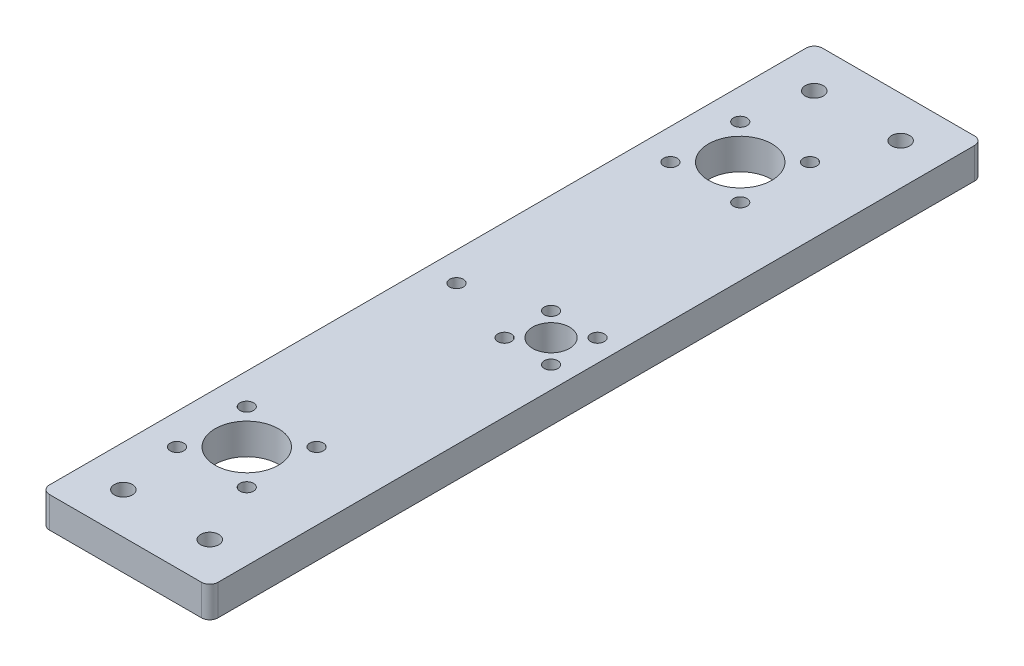
ISO-10303-21;
HEADER;
FILE_DESCRIPTION(('STEP AP214'),'2;1');
FILE_NAME('part.step','',(''),(''),'','','');
FILE_SCHEMA(('AUTOMOTIVE_DESIGN { 1 0 10303 214 1 1 1 1 }'));
ENDSEC;
DATA;
#1=APPLICATION_CONTEXT('core data for automotive mechanical design processes');
#2=APPLICATION_PROTOCOL_DEFINITION('international standard','automotive_design',2000,#1);
#3=PRODUCT_CONTEXT('',#1,'mechanical');
#4=PRODUCT('Part','Part','',(#3));
#5=PRODUCT_RELATED_PRODUCT_CATEGORY('part','',(#4));
#6=PRODUCT_DEFINITION_FORMATION('','',#4);
#7=PRODUCT_DEFINITION_CONTEXT('part definition',#1,'design');
#8=PRODUCT_DEFINITION('design','',#6,#7);
#9=PRODUCT_DEFINITION_SHAPE('','',#8);
#10=(LENGTH_UNIT() NAMED_UNIT(*) SI_UNIT(.MILLI.,.METRE.));
#11=(NAMED_UNIT(*) PLANE_ANGLE_UNIT() SI_UNIT($,.RADIAN.));
#12=(NAMED_UNIT(*) SI_UNIT($,.STERADIAN.) SOLID_ANGLE_UNIT());
#13=UNCERTAINTY_MEASURE_WITH_UNIT(LENGTH_MEASURE(1.E-05),#10,'distance_accuracy_value','');
#14=(GEOMETRIC_REPRESENTATION_CONTEXT(3) GLOBAL_UNCERTAINTY_ASSIGNED_CONTEXT((#13)) GLOBAL_UNIT_ASSIGNED_CONTEXT((#10,
#11,#12)) REPRESENTATION_CONTEXT('',''));
#15=CARTESIAN_POINT('',(0.,0.,0.));
#16=DIRECTION('',(0.,0.,1.));
#17=DIRECTION('',(1.,0.,0.));
#18=AXIS2_PLACEMENT_3D('',#15,#16,#17);
#19=CARTESIAN_POINT('',(18.5,0.,-92.));
#20=DIRECTION('',(0.,1.,0.));
#21=DIRECTION('',(0.,0.,1.));
#22=AXIS2_PLACEMENT_3D('',#19,#20,#21);
#23=CYLINDRICAL_SURFACE('',#22,2.);
#24=CARTESIAN_POINT('',(18.5,7.5,-92.));
#25=DIRECTION('',(0.,1.,0.));
#26=DIRECTION('',(0.,0.,1.));
#27=AXIS2_PLACEMENT_3D('',#24,#25,#26);
#28=CIRCLE('',#27,2.);
#29=CARTESIAN_POINT('',(20.5,7.5,-92.));
#30=VERTEX_POINT('',#29);
#31=CARTESIAN_POINT('',(18.5,7.5,-94.));
#32=VERTEX_POINT('',#31);
#33=EDGE_CURVE('E134',#30,#32,#28,.T.);
#34=ORIENTED_EDGE('',*,*,#33,.F.);
#35=DIRECTION('',(0.,1.,0.));
#36=VECTOR('',#35,1.);
#37=CARTESIAN_POINT('',(20.5,0.,-92.));
#38=LINE('',#37,#36);
#39=CARTESIAN_POINT('',(20.5,0.,-92.));
#40=VERTEX_POINT('',#39);
#41=EDGE_CURVE('E11',#40,#30,#38,.T.);
#42=ORIENTED_EDGE('',*,*,#41,.F.);
#43=CARTESIAN_POINT('',(18.5,0.,-92.));
#44=DIRECTION('',(0.,1.,0.));
#45=DIRECTION('',(0.,0.,1.));
#46=AXIS2_PLACEMENT_3D('',#43,#44,#45);
#47=CIRCLE('',#46,2.);
#48=CARTESIAN_POINT('',(18.5,0.,-94.));
#49=VERTEX_POINT('',#48);
#50=EDGE_CURVE('E155',#40,#49,#47,.T.);
#51=ORIENTED_EDGE('',*,*,#50,.T.);
#52=DIRECTION('',(0.,1.,0.));
#53=VECTOR('',#52,1.);
#54=CARTESIAN_POINT('',(18.5,0.,-94.));
#55=LINE('',#54,#53);
#56=EDGE_CURVE('E40',#49,#32,#55,.T.);
#57=ORIENTED_EDGE('',*,*,#56,.T.);
#58=EDGE_LOOP('',(#34,#42,#51,#57));
#59=FACE_BOUND('',#58,.T.);
#60=ADVANCED_FACE('F37',(#59),#23,.T.);
#61=CARTESIAN_POINT('',(20.5,0.,92.));
#62=DIRECTION('',(1.,0.,0.));
#63=DIRECTION('',(0.,0.,-1.));
#64=AXIS2_PLACEMENT_3D('',#61,#62,#63);
#65=PLANE('',#64);
#66=DIRECTION('',(0.,0.,-1.));
#67=VECTOR('',#66,1.);
#68=CARTESIAN_POINT('',(20.5,7.5,92.));
#69=LINE('',#68,#67);
#70=CARTESIAN_POINT('',(20.5,7.5,92.));
#71=VERTEX_POINT('',#70);
#72=EDGE_CURVE('E153',#71,#30,#69,.T.);
#73=ORIENTED_EDGE('',*,*,#72,.F.);
#74=DIRECTION('',(0.,1.,0.));
#75=VECTOR('',#74,1.);
#76=CARTESIAN_POINT('',(20.5,0.,92.));
#77=LINE('',#76,#75);
#78=CARTESIAN_POINT('',(20.5,0.,92.));
#79=VERTEX_POINT('',#78);
#80=EDGE_CURVE('E46',#79,#71,#77,.T.);
#81=ORIENTED_EDGE('',*,*,#80,.F.);
#82=DIRECTION('',(0.,0.,-1.));
#83=VECTOR('',#82,1.);
#84=CARTESIAN_POINT('',(20.5,0.,92.));
#85=LINE('',#84,#83);
#86=EDGE_CURVE('E124',#79,#40,#85,.T.);
#87=ORIENTED_EDGE('',*,*,#86,.T.);
#88=ORIENTED_EDGE('',*,*,#41,.T.);
#89=EDGE_LOOP('',(#73,#81,#87,#88));
#90=FACE_BOUND('',#89,.T.);
#91=ADVANCED_FACE('F167',(#90),#65,.T.);
#92=CARTESIAN_POINT('',(18.5,0.,92.));
#93=DIRECTION('',(0.,1.,0.));
#94=DIRECTION('',(0.,0.,1.));
#95=AXIS2_PLACEMENT_3D('',#92,#93,#94);
#96=CYLINDRICAL_SURFACE('',#95,2.);
#97=CARTESIAN_POINT('',(18.5,7.5,92.));
#98=DIRECTION('',(0.,1.,0.));
#99=DIRECTION('',(0.,0.,1.));
#100=AXIS2_PLACEMENT_3D('',#97,#98,#99);
#101=CIRCLE('',#100,2.);
#102=CARTESIAN_POINT('',(18.5,7.5,94.));
#103=VERTEX_POINT('',#102);
#104=EDGE_CURVE('E111',#103,#71,#101,.T.);
#105=ORIENTED_EDGE('',*,*,#104,.F.);
#106=DIRECTION('',(0.,1.,0.));
#107=VECTOR('',#106,1.);
#108=CARTESIAN_POINT('',(18.5,0.,94.));
#109=LINE('',#108,#107);
#110=CARTESIAN_POINT('',(18.5,0.,94.));
#111=VERTEX_POINT('',#110);
#112=EDGE_CURVE('E106',#111,#103,#109,.T.);
#113=ORIENTED_EDGE('',*,*,#112,.F.);
#114=CARTESIAN_POINT('',(18.5,0.,92.));
#115=DIRECTION('',(0.,1.,0.));
#116=DIRECTION('',(0.,0.,1.));
#117=AXIS2_PLACEMENT_3D('',#114,#115,#116);
#118=CIRCLE('',#117,2.);
#119=EDGE_CURVE('E109',#111,#79,#118,.T.);
#120=ORIENTED_EDGE('',*,*,#119,.T.);
#121=ORIENTED_EDGE('',*,*,#80,.T.);
#122=EDGE_LOOP('',(#105,#113,#120,#121));
#123=FACE_BOUND('',#122,.T.);
#124=ADVANCED_FACE('F108',(#123),#96,.T.);
#125=CARTESIAN_POINT('',(-18.5,0.,94.));
#126=DIRECTION('',(0.,0.,1.));
#127=DIRECTION('',(1.,0.,0.));
#128=AXIS2_PLACEMENT_3D('',#125,#126,#127);
#129=PLANE('',#128);
#130=DIRECTION('',(1.,0.,0.));
#131=VECTOR('',#130,1.);
#132=CARTESIAN_POINT('',(-18.5,7.5,94.));
#133=LINE('',#132,#131);
#134=CARTESIAN_POINT('',(-18.5,7.5,94.));
#135=VERTEX_POINT('',#134);
#136=EDGE_CURVE('E150',#135,#103,#133,.T.);
#137=ORIENTED_EDGE('',*,*,#136,.F.);
#138=DIRECTION('',(0.,1.,0.));
#139=VECTOR('',#138,1.);
#140=CARTESIAN_POINT('',(-18.5,0.,94.));
#141=LINE('',#140,#139);
#142=CARTESIAN_POINT('',(-18.5,0.,94.));
#143=VERTEX_POINT('',#142);
#144=EDGE_CURVE('E116',#143,#135,#141,.T.);
#145=ORIENTED_EDGE('',*,*,#144,.F.);
#146=DIRECTION('',(1.,0.,0.));
#147=VECTOR('',#146,1.);
#148=CARTESIAN_POINT('',(-18.5,0.,94.));
#149=LINE('',#148,#147);
#150=EDGE_CURVE('E122',#143,#111,#149,.T.);
#151=ORIENTED_EDGE('',*,*,#150,.T.);
#152=ORIENTED_EDGE('',*,*,#112,.T.);
#153=EDGE_LOOP('',(#137,#145,#151,#152));
#154=FACE_BOUND('',#153,.T.);
#155=ADVANCED_FACE('F126',(#154),#129,.T.);
#156=CARTESIAN_POINT('',(-18.5,0.,92.));
#157=DIRECTION('',(0.,1.,0.));
#158=DIRECTION('',(0.,0.,1.));
#159=AXIS2_PLACEMENT_3D('',#156,#157,#158);
#160=CYLINDRICAL_SURFACE('',#159,2.);
#161=CARTESIAN_POINT('',(-18.5,7.5,92.));
#162=DIRECTION('',(0.,1.,0.));
#163=DIRECTION('',(0.,0.,1.));
#164=AXIS2_PLACEMENT_3D('',#161,#162,#163);
#165=CIRCLE('',#164,2.);
#166=CARTESIAN_POINT('',(-20.5,7.5,92.));
#167=VERTEX_POINT('',#166);
#168=EDGE_CURVE('E147',#167,#135,#165,.T.);
#169=ORIENTED_EDGE('',*,*,#168,.F.);
#170=DIRECTION('',(0.,1.,0.));
#171=VECTOR('',#170,1.);
#172=CARTESIAN_POINT('',(-20.5,0.,92.));
#173=LINE('',#172,#171);
#174=CARTESIAN_POINT('',(-20.5,0.,92.));
#175=VERTEX_POINT('',#174);
#176=EDGE_CURVE('E159',#175,#167,#173,.T.);
#177=ORIENTED_EDGE('',*,*,#176,.F.);
#178=CARTESIAN_POINT('',(-18.5,0.,92.));
#179=DIRECTION('',(0.,1.,0.));
#180=DIRECTION('',(0.,0.,1.));
#181=AXIS2_PLACEMENT_3D('',#178,#179,#180);
#182=CIRCLE('',#181,2.);
#183=EDGE_CURVE('E127',#175,#143,#182,.T.);
#184=ORIENTED_EDGE('',*,*,#183,.T.);
#185=ORIENTED_EDGE('',*,*,#144,.T.);
#186=EDGE_LOOP('',(#169,#177,#184,#185));
#187=FACE_BOUND('',#186,.T.);
#188=ADVANCED_FACE('F180',(#187),#160,.T.);
#189=CARTESIAN_POINT('',(-20.5,0.,-92.));
#190=DIRECTION('',(-1.,0.,0.));
#191=DIRECTION('',(0.,0.,1.));
#192=AXIS2_PLACEMENT_3D('',#189,#190,#191);
#193=PLANE('',#192);
#194=DIRECTION('',(0.,0.,1.));
#195=VECTOR('',#194,1.);
#196=CARTESIAN_POINT('',(-20.5,7.5,-92.));
#197=LINE('',#196,#195);
#198=CARTESIAN_POINT('',(-20.5,7.5,-92.));
#199=VERTEX_POINT('',#198);
#200=EDGE_CURVE('E144',#199,#167,#197,.T.);
#201=ORIENTED_EDGE('',*,*,#200,.F.);
#202=DIRECTION('',(0.,1.,0.));
#203=VECTOR('',#202,1.);
#204=CARTESIAN_POINT('',(-20.5,0.,-92.));
#205=LINE('',#204,#203);
#206=CARTESIAN_POINT('',(-20.5,0.,-92.));
#207=VERTEX_POINT('',#206);
#208=EDGE_CURVE('E161',#207,#199,#205,.T.);
#209=ORIENTED_EDGE('',*,*,#208,.F.);
#210=DIRECTION('',(0.,0.,1.));
#211=VECTOR('',#210,1.);
#212=CARTESIAN_POINT('',(-20.5,0.,-92.));
#213=LINE('',#212,#211);
#214=EDGE_CURVE('E129',#207,#175,#213,.T.);
#215=ORIENTED_EDGE('',*,*,#214,.T.);
#216=ORIENTED_EDGE('',*,*,#176,.T.);
#217=EDGE_LOOP('',(#201,#209,#215,#216));
#218=FACE_BOUND('',#217,.T.);
#219=ADVANCED_FACE('F183',(#218),#193,.T.);
#220=CARTESIAN_POINT('',(-18.5,0.,-92.));
#221=DIRECTION('',(0.,1.,0.));
#222=DIRECTION('',(0.,0.,1.));
#223=AXIS2_PLACEMENT_3D('',#220,#221,#222);
#224=CYLINDRICAL_SURFACE('',#223,2.);
#225=CARTESIAN_POINT('',(-18.5,7.5,-92.));
#226=DIRECTION('',(0.,1.,0.));
#227=DIRECTION('',(0.,0.,1.));
#228=AXIS2_PLACEMENT_3D('',#225,#226,#227);
#229=CIRCLE('',#228,2.);
#230=CARTESIAN_POINT('',(-18.5,7.5,-94.));
#231=VERTEX_POINT('',#230);
#232=EDGE_CURVE('E141',#231,#199,#229,.T.);
#233=ORIENTED_EDGE('',*,*,#232,.F.);
#234=DIRECTION('',(0.,1.,0.));
#235=VECTOR('',#234,1.);
#236=CARTESIAN_POINT('',(-18.5,0.,-94.));
#237=LINE('',#236,#235);
#238=CARTESIAN_POINT('',(-18.5,0.,-94.));
#239=VERTEX_POINT('',#238);
#240=EDGE_CURVE('E162',#239,#231,#237,.T.);
#241=ORIENTED_EDGE('',*,*,#240,.F.);
#242=CARTESIAN_POINT('',(-18.5,0.,-92.));
#243=DIRECTION('',(0.,1.,0.));
#244=DIRECTION('',(0.,0.,1.));
#245=AXIS2_PLACEMENT_3D('',#242,#243,#244);
#246=CIRCLE('',#245,2.);
#247=EDGE_CURVE('E409',#239,#207,#246,.T.);
#248=ORIENTED_EDGE('',*,*,#247,.T.);
#249=ORIENTED_EDGE('',*,*,#208,.T.);
#250=EDGE_LOOP('',(#233,#241,#248,#249));
#251=FACE_BOUND('',#250,.T.);
#252=ADVANCED_FACE('F187',(#251),#224,.T.);
#253=CARTESIAN_POINT('',(18.5,0.,-94.));
#254=DIRECTION('',(0.,0.,-1.));
#255=DIRECTION('',(-1.,0.,0.));
#256=AXIS2_PLACEMENT_3D('',#253,#254,#255);
#257=PLANE('',#256);
#258=DIRECTION('',(-1.,0.,0.));
#259=VECTOR('',#258,1.);
#260=CARTESIAN_POINT('',(18.5,7.5,-94.));
#261=LINE('',#260,#259);
#262=EDGE_CURVE('E137',#32,#231,#261,.T.);
#263=ORIENTED_EDGE('',*,*,#262,.F.);
#264=ORIENTED_EDGE('',*,*,#56,.F.);
#265=DIRECTION('',(-1.,0.,0.));
#266=VECTOR('',#265,1.);
#267=CARTESIAN_POINT('',(18.5,0.,-94.));
#268=LINE('',#267,#266);
#269=EDGE_CURVE('E407',#49,#239,#268,.T.);
#270=ORIENTED_EDGE('',*,*,#269,.T.);
#271=ORIENTED_EDGE('',*,*,#240,.T.);
#272=EDGE_LOOP('',(#263,#264,#270,#271));
#273=FACE_BOUND('',#272,.T.);
#274=ADVANCED_FACE('F164',(#273),#257,.T.);
#275=CARTESIAN_POINT('',(18.5,0.,-92.));
#276=DIRECTION('',(0.,1.,0.));
#277=DIRECTION('',(0.,0.,1.));
#278=AXIS2_PLACEMENT_3D('',#275,#276,#277);
#279=PLANE('',#278);
#280=CARTESIAN_POINT('',(-4.5,0.,-60.));
#281=DIRECTION('',(0.,1.,0.));
#282=DIRECTION('',(0.,0.,-1.));
#283=AXIS2_PLACEMENT_3D('',#280,#281,#282);
#284=CIRCLE('',#283,7.7);
#285=CARTESIAN_POINT('',(-4.5,0.,-67.7));
#286=VERTEX_POINT('',#285);
#287=EDGE_CURVE('E286',#286,#286,#284,.T.);
#288=ORIENTED_EDGE('',*,*,#287,.T.);
#289=EDGE_LOOP('',(#288));
#290=FACE_BOUND('',#289,.T.);
#291=CARTESIAN_POINT('',(-13.5,0.,0.));
#292=DIRECTION('',(0.,1.,0.));
#293=DIRECTION('',(0.,0.,-1.));
#294=AXIS2_PLACEMENT_3D('',#291,#292,#293);
#295=CIRCLE('',#294,1.65);
#296=CARTESIAN_POINT('',(-13.5,0.,-1.65));
#297=VERTEX_POINT('',#296);
#298=EDGE_CURVE('E294',#297,#297,#295,.T.);
#299=ORIENTED_EDGE('',*,*,#298,.T.);
#300=EDGE_LOOP('',(#299));
#301=FACE_BOUND('',#300,.T.);
#302=CARTESIAN_POINT('',(15.1568542494924,0.,5.65685424949238));
#303=DIRECTION('',(0.,1.,0.));
#304=DIRECTION('',(0.,0.,-1.));
#305=AXIS2_PLACEMENT_3D('',#302,#303,#304);
#306=CIRCLE('',#305,1.65);
#307=CARTESIAN_POINT('',(15.1568542494924,0.,4.00685424949238));
#308=VERTEX_POINT('',#307);
#309=EDGE_CURVE('E300',#308,#308,#306,.T.);
#310=ORIENTED_EDGE('',*,*,#309,.T.);
#311=EDGE_LOOP('',(#310));
#312=FACE_BOUND('',#311,.T.);
#313=CARTESIAN_POINT('',(3.84314575050763,0.,5.65685424949238));
#314=DIRECTION('',(0.,1.,0.));
#315=DIRECTION('',(0.,0.,-1.));
#316=AXIS2_PLACEMENT_3D('',#313,#314,#315);
#317=CIRCLE('',#316,1.65);
#318=CARTESIAN_POINT('',(3.84314575050763,0.,4.00685424949238));
#319=VERTEX_POINT('',#318);
#320=EDGE_CURVE('E306',#319,#319,#317,.T.);
#321=ORIENTED_EDGE('',*,*,#320,.T.);
#322=EDGE_LOOP('',(#321));
#323=FACE_BOUND('',#322,.T.);
#324=CARTESIAN_POINT('',(3.84314575050763,0.,-5.65685424949238));
#325=DIRECTION('',(0.,1.,0.));
#326=DIRECTION('',(0.,0.,-1.));
#327=AXIS2_PLACEMENT_3D('',#324,#325,#326);
#328=CIRCLE('',#327,1.65);
#329=CARTESIAN_POINT('',(3.84314575050763,0.,-7.30685424949238));
#330=VERTEX_POINT('',#329);
#331=EDGE_CURVE('E312',#330,#330,#328,.T.);
#332=ORIENTED_EDGE('',*,*,#331,.T.);
#333=EDGE_LOOP('',(#332));
#334=FACE_BOUND('',#333,.T.);
#335=CARTESIAN_POINT('',(-12.9852813742386,0.,-51.5147186257614));
#336=DIRECTION('',(0.,1.,0.));
#337=DIRECTION('',(0.,0.,-1.));
#338=AXIS2_PLACEMENT_3D('',#335,#336,#337);
#339=CIRCLE('',#338,1.65);
#340=CARTESIAN_POINT('',(-12.9852813742386,0.,-53.1647186257614));
#341=VERTEX_POINT('',#340);
#342=EDGE_CURVE('E318',#341,#341,#339,.T.);
#343=ORIENTED_EDGE('',*,*,#342,.T.);
#344=EDGE_LOOP('',(#343));
#345=FACE_BOUND('',#344,.T.);
#346=CARTESIAN_POINT('',(-12.9852813742386,0.,-68.4852813742386));
#347=DIRECTION('',(0.,1.,0.));
#348=DIRECTION('',(0.,0.,-1.));
#349=AXIS2_PLACEMENT_3D('',#346,#347,#348);
#350=CIRCLE('',#349,1.65);
#351=CARTESIAN_POINT('',(-12.9852813742386,0.,-70.1352813742386));
#352=VERTEX_POINT('',#351);
#353=EDGE_CURVE('E324',#352,#352,#350,.T.);
#354=ORIENTED_EDGE('',*,*,#353,.T.);
#355=EDGE_LOOP('',(#354));
#356=FACE_BOUND('',#355,.T.);
#357=CARTESIAN_POINT('',(3.98528137423856,0.,-68.4852813742386));
#358=DIRECTION('',(0.,1.,0.));
#359=DIRECTION('',(0.,0.,-1.));
#360=AXIS2_PLACEMENT_3D('',#357,#358,#359);
#361=CIRCLE('',#360,1.65);
#362=CARTESIAN_POINT('',(3.98528137423856,0.,-70.1352813742386));
#363=VERTEX_POINT('',#362);
#364=EDGE_CURVE('E330',#363,#363,#361,.T.);
#365=ORIENTED_EDGE('',*,*,#364,.T.);
#366=EDGE_LOOP('',(#365));
#367=FACE_BOUND('',#366,.T.);
#368=CARTESIAN_POINT('',(3.98528137423858,0.,51.5147186257614));
#369=DIRECTION('',(0.,1.,0.));
#370=DIRECTION('',(0.,0.,-1.));
#371=AXIS2_PLACEMENT_3D('',#368,#369,#370);
#372=CIRCLE('',#371,1.65);
#373=CARTESIAN_POINT('',(3.98528137423858,0.,49.8647186257614));
#374=VERTEX_POINT('',#373);
#375=EDGE_CURVE('E336',#374,#374,#372,.T.);
#376=ORIENTED_EDGE('',*,*,#375,.T.);
#377=EDGE_LOOP('',(#376));
#378=FACE_BOUND('',#377,.T.);
#379=CARTESIAN_POINT('',(-12.9852813742386,0.,51.5147186257614));
#380=DIRECTION('',(0.,1.,0.));
#381=DIRECTION('',(0.,0.,-1.));
#382=AXIS2_PLACEMENT_3D('',#379,#380,#381);
#383=CIRCLE('',#382,1.65);
#384=CARTESIAN_POINT('',(-12.9852813742386,0.,49.8647186257614));
#385=VERTEX_POINT('',#384);
#386=EDGE_CURVE('E342',#385,#385,#383,.T.);
#387=ORIENTED_EDGE('',*,*,#386,.T.);
#388=EDGE_LOOP('',(#387));
#389=FACE_BOUND('',#388,.T.);
#390=CARTESIAN_POINT('',(9.5,0.,0.));
#391=DIRECTION('',(0.,1.,0.));
#392=DIRECTION('',(0.,0.,-1.));
#393=AXIS2_PLACEMENT_3D('',#390,#391,#392);
#394=CIRCLE('',#393,4.5);
#395=CARTESIAN_POINT('',(9.5,0.,-4.5));
#396=VERTEX_POINT('',#395);
#397=EDGE_CURVE('E348',#396,#396,#394,.T.);
#398=ORIENTED_EDGE('',*,*,#397,.T.);
#399=EDGE_LOOP('',(#398));
#400=FACE_BOUND('',#399,.T.);
#401=CARTESIAN_POINT('',(-4.5,0.,60.));
#402=DIRECTION('',(0.,1.,0.));
#403=DIRECTION('',(0.,0.,-1.));
#404=AXIS2_PLACEMENT_3D('',#401,#402,#403);
#405=CIRCLE('',#404,7.7);
#406=CARTESIAN_POINT('',(-4.5,0.,52.3));
#407=VERTEX_POINT('',#406);
#408=EDGE_CURVE('E354',#407,#407,#405,.T.);
#409=ORIENTED_EDGE('',*,*,#408,.T.);
#410=EDGE_LOOP('',(#409));
#411=FACE_BOUND('',#410,.T.);
#412=CARTESIAN_POINT('',(3.98528137423858,0.,68.4852813742386));
#413=DIRECTION('',(0.,1.,0.));
#414=DIRECTION('',(0.,0.,-1.));
#415=AXIS2_PLACEMENT_3D('',#412,#413,#414);
#416=CIRCLE('',#415,1.65);
#417=CARTESIAN_POINT('',(3.98528137423858,0.,66.8352813742386));
#418=VERTEX_POINT('',#417);
#419=EDGE_CURVE('E360',#418,#418,#416,.T.);
#420=ORIENTED_EDGE('',*,*,#419,.T.);
#421=EDGE_LOOP('',(#420));
#422=FACE_BOUND('',#421,.T.);
#423=CARTESIAN_POINT('',(-12.9852813742386,0.,68.4852813742386));
#424=DIRECTION('',(0.,1.,0.));
#425=DIRECTION('',(0.,0.,-1.));
#426=AXIS2_PLACEMENT_3D('',#423,#424,#425);
#427=CIRCLE('',#426,1.65);
#428=CARTESIAN_POINT('',(-12.9852813742386,0.,66.8352813742386));
#429=VERTEX_POINT('',#428);
#430=EDGE_CURVE('E366',#429,#429,#427,.T.);
#431=ORIENTED_EDGE('',*,*,#430,.T.);
#432=EDGE_LOOP('',(#431));
#433=FACE_BOUND('',#432,.T.);
#434=CARTESIAN_POINT('',(15.1568542494924,0.,-5.65685424949238));
#435=DIRECTION('',(0.,1.,0.));
#436=DIRECTION('',(0.,0.,-1.));
#437=AXIS2_PLACEMENT_3D('',#434,#435,#436);
#438=CIRCLE('',#437,1.65);
#439=CARTESIAN_POINT('',(15.1568542494924,0.,-7.30685424949238));
#440=VERTEX_POINT('',#439);
#441=EDGE_CURVE('E372',#440,#440,#438,.T.);
#442=ORIENTED_EDGE('',*,*,#441,.T.);
#443=EDGE_LOOP('',(#442));
#444=FACE_BOUND('',#443,.T.);
#445=CARTESIAN_POINT('',(3.98528137423857,0.,-51.5147186257614));
#446=DIRECTION('',(0.,1.,0.));
#447=DIRECTION('',(0.,0.,-1.));
#448=AXIS2_PLACEMENT_3D('',#445,#446,#447);
#449=CIRCLE('',#448,1.65);
#450=CARTESIAN_POINT('',(3.98528137423857,0.,-53.1647186257614));
#451=VERTEX_POINT('',#450);
#452=EDGE_CURVE('E378',#451,#451,#449,.T.);
#453=ORIENTED_EDGE('',*,*,#452,.T.);
#454=EDGE_LOOP('',(#453));
#455=FACE_BOUND('',#454,.T.);
#456=CARTESIAN_POINT('',(-10.5,0.,84.));
#457=DIRECTION('',(0.,1.,0.));
#458=DIRECTION('',(0.,0.,-1.));
#459=AXIS2_PLACEMENT_3D('',#456,#457,#458);
#460=CIRCLE('',#459,2.19999999999999);
#461=CARTESIAN_POINT('',(-10.5,0.,81.8));
#462=VERTEX_POINT('',#461);
#463=EDGE_CURVE('E384',#462,#462,#460,.T.);
#464=ORIENTED_EDGE('',*,*,#463,.T.);
#465=EDGE_LOOP('',(#464));
#466=FACE_BOUND('',#465,.T.);
#467=CARTESIAN_POINT('',(10.5,0.,84.));
#468=DIRECTION('',(0.,1.,0.));
#469=DIRECTION('',(0.,0.,-1.));
#470=AXIS2_PLACEMENT_3D('',#467,#468,#469);
#471=CIRCLE('',#470,2.19999999999999);
#472=CARTESIAN_POINT('',(10.5,0.,81.8));
#473=VERTEX_POINT('',#472);
#474=EDGE_CURVE('E390',#473,#473,#471,.T.);
#475=ORIENTED_EDGE('',*,*,#474,.T.);
#476=EDGE_LOOP('',(#475));
#477=FACE_BOUND('',#476,.T.);
#478=CARTESIAN_POINT('',(-10.5,0.,-84.));
#479=DIRECTION('',(0.,1.,0.));
#480=DIRECTION('',(0.,0.,-1.));
#481=AXIS2_PLACEMENT_3D('',#478,#479,#480);
#482=CIRCLE('',#481,2.19999999999999);
#483=CARTESIAN_POINT('',(-10.5,0.,-86.2));
#484=VERTEX_POINT('',#483);
#485=EDGE_CURVE('E396',#484,#484,#482,.T.);
#486=ORIENTED_EDGE('',*,*,#485,.T.);
#487=EDGE_LOOP('',(#486));
#488=FACE_BOUND('',#487,.T.);
#489=CARTESIAN_POINT('',(10.5,0.,-84.));
#490=DIRECTION('',(0.,1.,0.));
#491=DIRECTION('',(0.,0.,-1.));
#492=AXIS2_PLACEMENT_3D('',#489,#490,#491);
#493=CIRCLE('',#492,2.19999999999999);
#494=CARTESIAN_POINT('',(10.5,0.,-86.2));
#495=VERTEX_POINT('',#494);
#496=EDGE_CURVE('E138',#495,#495,#493,.T.);
#497=ORIENTED_EDGE('',*,*,#496,.T.);
#498=EDGE_LOOP('',(#497));
#499=FACE_BOUND('',#498,.T.);
#500=ORIENTED_EDGE('',*,*,#50,.F.);
#501=ORIENTED_EDGE('',*,*,#86,.F.);
#502=ORIENTED_EDGE('',*,*,#119,.F.);
#503=ORIENTED_EDGE('',*,*,#150,.F.);
#504=ORIENTED_EDGE('',*,*,#183,.F.);
#505=ORIENTED_EDGE('',*,*,#214,.F.);
#506=ORIENTED_EDGE('',*,*,#247,.F.);
#507=ORIENTED_EDGE('',*,*,#269,.F.);
#508=EDGE_LOOP('',(#500,#501,#502,#503,#504,#505,#506,#507));
#509=FACE_BOUND('',#508,.T.);
#510=ADVANCED_FACE('F120',(#290,#301,#312,#323,#334,#345,#356,#367,#378,#389,#400,#411,#422,
#433,#444,#455,#466,#477,#488,#499,#509),#279,.F.);
#511=CARTESIAN_POINT('',(18.5,7.5,-92.));
#512=DIRECTION('',(0.,1.,0.));
#513=DIRECTION('',(0.,0.,1.));
#514=AXIS2_PLACEMENT_3D('',#511,#512,#513);
#515=PLANE('',#514);
#516=CARTESIAN_POINT('',(-4.5,7.5,-60.));
#517=DIRECTION('',(0.,1.,0.));
#518=DIRECTION('',(0.,0.,-1.));
#519=AXIS2_PLACEMENT_3D('',#516,#517,#518);
#520=CIRCLE('',#519,7.7);
#521=CARTESIAN_POINT('',(-4.5,7.5,-67.7));
#522=VERTEX_POINT('',#521);
#523=EDGE_CURVE('E289',#522,#522,#520,.T.);
#524=ORIENTED_EDGE('',*,*,#523,.F.);
#525=EDGE_LOOP('',(#524));
#526=FACE_BOUND('',#525,.T.);
#527=CARTESIAN_POINT('',(-13.5,7.5,0.));
#528=DIRECTION('',(0.,1.,0.));
#529=DIRECTION('',(0.,0.,-1.));
#530=AXIS2_PLACEMENT_3D('',#527,#528,#529);
#531=CIRCLE('',#530,1.65);
#532=CARTESIAN_POINT('',(-13.5,7.5,-1.65));
#533=VERTEX_POINT('',#532);
#534=EDGE_CURVE('E291',#533,#533,#531,.T.);
#535=ORIENTED_EDGE('',*,*,#534,.F.);
#536=EDGE_LOOP('',(#535));
#537=FACE_BOUND('',#536,.T.);
#538=CARTESIAN_POINT('',(15.1568542494924,7.5,5.65685424949238));
#539=DIRECTION('',(0.,1.,0.));
#540=DIRECTION('',(0.,0.,-1.));
#541=AXIS2_PLACEMENT_3D('',#538,#539,#540);
#542=CIRCLE('',#541,1.65);
#543=CARTESIAN_POINT('',(15.1568542494924,7.5,4.00685424949238));
#544=VERTEX_POINT('',#543);
#545=EDGE_CURVE('E297',#544,#544,#542,.T.);
#546=ORIENTED_EDGE('',*,*,#545,.F.);
#547=EDGE_LOOP('',(#546));
#548=FACE_BOUND('',#547,.T.);
#549=CARTESIAN_POINT('',(3.84314575050763,7.5,5.65685424949238));
#550=DIRECTION('',(0.,1.,0.));
#551=DIRECTION('',(0.,0.,-1.));
#552=AXIS2_PLACEMENT_3D('',#549,#550,#551);
#553=CIRCLE('',#552,1.65);
#554=CARTESIAN_POINT('',(3.84314575050763,7.5,4.00685424949238));
#555=VERTEX_POINT('',#554);
#556=EDGE_CURVE('E303',#555,#555,#553,.T.);
#557=ORIENTED_EDGE('',*,*,#556,.F.);
#558=EDGE_LOOP('',(#557));
#559=FACE_BOUND('',#558,.T.);
#560=CARTESIAN_POINT('',(3.84314575050763,7.5,-5.65685424949238));
#561=DIRECTION('',(0.,1.,0.));
#562=DIRECTION('',(0.,0.,-1.));
#563=AXIS2_PLACEMENT_3D('',#560,#561,#562);
#564=CIRCLE('',#563,1.65);
#565=CARTESIAN_POINT('',(3.84314575050763,7.5,-7.30685424949238));
#566=VERTEX_POINT('',#565);
#567=EDGE_CURVE('E309',#566,#566,#564,.T.);
#568=ORIENTED_EDGE('',*,*,#567,.F.);
#569=EDGE_LOOP('',(#568));
#570=FACE_BOUND('',#569,.T.);
#571=CARTESIAN_POINT('',(-12.9852813742386,7.5,-51.5147186257614));
#572=DIRECTION('',(0.,1.,0.));
#573=DIRECTION('',(0.,0.,-1.));
#574=AXIS2_PLACEMENT_3D('',#571,#572,#573);
#575=CIRCLE('',#574,1.65);
#576=CARTESIAN_POINT('',(-12.9852813742386,7.5,-53.1647186257614));
#577=VERTEX_POINT('',#576);
#578=EDGE_CURVE('E315',#577,#577,#575,.T.);
#579=ORIENTED_EDGE('',*,*,#578,.F.);
#580=EDGE_LOOP('',(#579));
#581=FACE_BOUND('',#580,.T.);
#582=CARTESIAN_POINT('',(-12.9852813742386,7.5,-68.4852813742386));
#583=DIRECTION('',(0.,1.,0.));
#584=DIRECTION('',(0.,0.,-1.));
#585=AXIS2_PLACEMENT_3D('',#582,#583,#584);
#586=CIRCLE('',#585,1.65);
#587=CARTESIAN_POINT('',(-12.9852813742386,7.5,-70.1352813742386));
#588=VERTEX_POINT('',#587);
#589=EDGE_CURVE('E321',#588,#588,#586,.T.);
#590=ORIENTED_EDGE('',*,*,#589,.F.);
#591=EDGE_LOOP('',(#590));
#592=FACE_BOUND('',#591,.T.);
#593=CARTESIAN_POINT('',(3.98528137423856,7.5,-68.4852813742386));
#594=DIRECTION('',(0.,1.,0.));
#595=DIRECTION('',(0.,0.,-1.));
#596=AXIS2_PLACEMENT_3D('',#593,#594,#595);
#597=CIRCLE('',#596,1.65);
#598=CARTESIAN_POINT('',(3.98528137423856,7.5,-70.1352813742386));
#599=VERTEX_POINT('',#598);
#600=EDGE_CURVE('E327',#599,#599,#597,.T.);
#601=ORIENTED_EDGE('',*,*,#600,.F.);
#602=EDGE_LOOP('',(#601));
#603=FACE_BOUND('',#602,.T.);
#604=CARTESIAN_POINT('',(3.98528137423858,7.5,51.5147186257614));
#605=DIRECTION('',(0.,1.,0.));
#606=DIRECTION('',(0.,0.,-1.));
#607=AXIS2_PLACEMENT_3D('',#604,#605,#606);
#608=CIRCLE('',#607,1.65);
#609=CARTESIAN_POINT('',(3.98528137423858,7.5,49.8647186257614));
#610=VERTEX_POINT('',#609);
#611=EDGE_CURVE('E333',#610,#610,#608,.T.);
#612=ORIENTED_EDGE('',*,*,#611,.F.);
#613=EDGE_LOOP('',(#612));
#614=FACE_BOUND('',#613,.T.);
#615=CARTESIAN_POINT('',(-12.9852813742386,7.5,51.5147186257614));
#616=DIRECTION('',(0.,1.,0.));
#617=DIRECTION('',(0.,0.,-1.));
#618=AXIS2_PLACEMENT_3D('',#615,#616,#617);
#619=CIRCLE('',#618,1.65);
#620=CARTESIAN_POINT('',(-12.9852813742386,7.5,49.8647186257614));
#621=VERTEX_POINT('',#620);
#622=EDGE_CURVE('E339',#621,#621,#619,.T.);
#623=ORIENTED_EDGE('',*,*,#622,.F.);
#624=EDGE_LOOP('',(#623));
#625=FACE_BOUND('',#624,.T.);
#626=CARTESIAN_POINT('',(9.5,7.5,0.));
#627=DIRECTION('',(0.,1.,0.));
#628=DIRECTION('',(0.,0.,-1.));
#629=AXIS2_PLACEMENT_3D('',#626,#627,#628);
#630=CIRCLE('',#629,4.5);
#631=CARTESIAN_POINT('',(9.5,7.5,-4.5));
#632=VERTEX_POINT('',#631);
#633=EDGE_CURVE('E345',#632,#632,#630,.T.);
#634=ORIENTED_EDGE('',*,*,#633,.F.);
#635=EDGE_LOOP('',(#634));
#636=FACE_BOUND('',#635,.T.);
#637=CARTESIAN_POINT('',(-4.5,7.5,60.));
#638=DIRECTION('',(0.,1.,0.));
#639=DIRECTION('',(0.,0.,-1.));
#640=AXIS2_PLACEMENT_3D('',#637,#638,#639);
#641=CIRCLE('',#640,7.7);
#642=CARTESIAN_POINT('',(-4.5,7.5,52.3));
#643=VERTEX_POINT('',#642);
#644=EDGE_CURVE('E351',#643,#643,#641,.T.);
#645=ORIENTED_EDGE('',*,*,#644,.F.);
#646=EDGE_LOOP('',(#645));
#647=FACE_BOUND('',#646,.T.);
#648=CARTESIAN_POINT('',(3.98528137423858,7.5,68.4852813742386));
#649=DIRECTION('',(0.,1.,0.));
#650=DIRECTION('',(0.,0.,-1.));
#651=AXIS2_PLACEMENT_3D('',#648,#649,#650);
#652=CIRCLE('',#651,1.65);
#653=CARTESIAN_POINT('',(3.98528137423858,7.5,66.8352813742386));
#654=VERTEX_POINT('',#653);
#655=EDGE_CURVE('E357',#654,#654,#652,.T.);
#656=ORIENTED_EDGE('',*,*,#655,.F.);
#657=EDGE_LOOP('',(#656));
#658=FACE_BOUND('',#657,.T.);
#659=CARTESIAN_POINT('',(-12.9852813742386,7.5,68.4852813742386));
#660=DIRECTION('',(0.,1.,0.));
#661=DIRECTION('',(0.,0.,-1.));
#662=AXIS2_PLACEMENT_3D('',#659,#660,#661);
#663=CIRCLE('',#662,1.65);
#664=CARTESIAN_POINT('',(-12.9852813742386,7.5,66.8352813742386));
#665=VERTEX_POINT('',#664);
#666=EDGE_CURVE('E363',#665,#665,#663,.T.);
#667=ORIENTED_EDGE('',*,*,#666,.F.);
#668=EDGE_LOOP('',(#667));
#669=FACE_BOUND('',#668,.T.);
#670=CARTESIAN_POINT('',(15.1568542494924,7.5,-5.65685424949238));
#671=DIRECTION('',(0.,1.,0.));
#672=DIRECTION('',(0.,0.,-1.));
#673=AXIS2_PLACEMENT_3D('',#670,#671,#672);
#674=CIRCLE('',#673,1.65);
#675=CARTESIAN_POINT('',(15.1568542494924,7.5,-7.30685424949238));
#676=VERTEX_POINT('',#675);
#677=EDGE_CURVE('E369',#676,#676,#674,.T.);
#678=ORIENTED_EDGE('',*,*,#677,.F.);
#679=EDGE_LOOP('',(#678));
#680=FACE_BOUND('',#679,.T.);
#681=CARTESIAN_POINT('',(3.98528137423857,7.5,-51.5147186257614));
#682=DIRECTION('',(0.,1.,0.));
#683=DIRECTION('',(0.,0.,-1.));
#684=AXIS2_PLACEMENT_3D('',#681,#682,#683);
#685=CIRCLE('',#684,1.65);
#686=CARTESIAN_POINT('',(3.98528137423857,7.5,-53.1647186257614));
#687=VERTEX_POINT('',#686);
#688=EDGE_CURVE('E375',#687,#687,#685,.T.);
#689=ORIENTED_EDGE('',*,*,#688,.F.);
#690=EDGE_LOOP('',(#689));
#691=FACE_BOUND('',#690,.T.);
#692=CARTESIAN_POINT('',(-10.5,7.5,84.));
#693=DIRECTION('',(0.,1.,0.));
#694=DIRECTION('',(0.,0.,-1.));
#695=AXIS2_PLACEMENT_3D('',#692,#693,#694);
#696=CIRCLE('',#695,2.19999999999999);
#697=CARTESIAN_POINT('',(-10.5,7.5,81.8));
#698=VERTEX_POINT('',#697);
#699=EDGE_CURVE('E381',#698,#698,#696,.T.);
#700=ORIENTED_EDGE('',*,*,#699,.F.);
#701=EDGE_LOOP('',(#700));
#702=FACE_BOUND('',#701,.T.);
#703=CARTESIAN_POINT('',(10.5,7.5,84.));
#704=DIRECTION('',(0.,1.,0.));
#705=DIRECTION('',(0.,0.,-1.));
#706=AXIS2_PLACEMENT_3D('',#703,#704,#705);
#707=CIRCLE('',#706,2.19999999999999);
#708=CARTESIAN_POINT('',(10.5,7.5,81.8));
#709=VERTEX_POINT('',#708);
#710=EDGE_CURVE('E387',#709,#709,#707,.T.);
#711=ORIENTED_EDGE('',*,*,#710,.F.);
#712=EDGE_LOOP('',(#711));
#713=FACE_BOUND('',#712,.T.);
#714=CARTESIAN_POINT('',(-10.5,7.5,-84.));
#715=DIRECTION('',(0.,1.,0.));
#716=DIRECTION('',(0.,0.,-1.));
#717=AXIS2_PLACEMENT_3D('',#714,#715,#716);
#718=CIRCLE('',#717,2.19999999999999);
#719=CARTESIAN_POINT('',(-10.5,7.5,-86.2));
#720=VERTEX_POINT('',#719);
#721=EDGE_CURVE('E393',#720,#720,#718,.T.);
#722=ORIENTED_EDGE('',*,*,#721,.F.);
#723=EDGE_LOOP('',(#722));
#724=FACE_BOUND('',#723,.T.);
#725=CARTESIAN_POINT('',(10.5,7.5,-84.));
#726=DIRECTION('',(0.,1.,0.));
#727=DIRECTION('',(0.,0.,-1.));
#728=AXIS2_PLACEMENT_3D('',#725,#726,#727);
#729=CIRCLE('',#728,2.19999999999999);
#730=CARTESIAN_POINT('',(10.5,7.5,-86.2));
#731=VERTEX_POINT('',#730);
#732=EDGE_CURVE('E399',#731,#731,#729,.T.);
#733=ORIENTED_EDGE('',*,*,#732,.F.);
#734=EDGE_LOOP('',(#733));
#735=FACE_BOUND('',#734,.T.);
#736=ORIENTED_EDGE('',*,*,#33,.T.);
#737=ORIENTED_EDGE('',*,*,#262,.T.);
#738=ORIENTED_EDGE('',*,*,#232,.T.);
#739=ORIENTED_EDGE('',*,*,#200,.T.);
#740=ORIENTED_EDGE('',*,*,#168,.T.);
#741=ORIENTED_EDGE('',*,*,#136,.T.);
#742=ORIENTED_EDGE('',*,*,#104,.T.);
#743=ORIENTED_EDGE('',*,*,#72,.T.);
#744=EDGE_LOOP('',(#736,#737,#738,#739,#740,#741,#742,#743));
#745=FACE_BOUND('',#744,.T.);
#746=ADVANCED_FACE('F166',(#526,#537,#548,#559,#570,#581,#592,#603,#614,#625,#636,#647,#658,
#669,#680,#691,#702,#713,#724,#735,#745),#515,.T.);
#747=CARTESIAN_POINT('',(10.5,0.,-84.));
#748=DIRECTION('',(0.,1.,0.));
#749=DIRECTION('',(0.,0.,1.));
#750=AXIS2_PLACEMENT_3D('',#747,#748,#749);
#751=CYLINDRICAL_SURFACE('',#750,2.19999999999999);
#752=ORIENTED_EDGE('',*,*,#496,.F.);
#753=EDGE_LOOP('',(#752));
#754=FACE_BOUND('',#753,.T.);
#755=ORIENTED_EDGE('',*,*,#732,.T.);
#756=EDGE_LOOP('',(#755));
#757=FACE_BOUND('',#756,.T.);
#758=ADVANCED_FACE('F199',(#754,#757),#751,.F.);
#759=CARTESIAN_POINT('',(-10.5,0.,-84.));
#760=DIRECTION('',(0.,1.,0.));
#761=DIRECTION('',(0.,0.,1.));
#762=AXIS2_PLACEMENT_3D('',#759,#760,#761);
#763=CYLINDRICAL_SURFACE('',#762,2.19999999999999);
#764=ORIENTED_EDGE('',*,*,#485,.F.);
#765=EDGE_LOOP('',(#764));
#766=FACE_BOUND('',#765,.T.);
#767=ORIENTED_EDGE('',*,*,#721,.T.);
#768=EDGE_LOOP('',(#767));
#769=FACE_BOUND('',#768,.T.);
#770=ADVANCED_FACE('F206',(#766,#769),#763,.F.);
#771=CARTESIAN_POINT('',(10.5,0.,84.));
#772=DIRECTION('',(0.,1.,0.));
#773=DIRECTION('',(0.,0.,1.));
#774=AXIS2_PLACEMENT_3D('',#771,#772,#773);
#775=CYLINDRICAL_SURFACE('',#774,2.19999999999999);
#776=ORIENTED_EDGE('',*,*,#474,.F.);
#777=EDGE_LOOP('',(#776));
#778=FACE_BOUND('',#777,.T.);
#779=ORIENTED_EDGE('',*,*,#710,.T.);
#780=EDGE_LOOP('',(#779));
#781=FACE_BOUND('',#780,.T.);
#782=ADVANCED_FACE('F210',(#778,#781),#775,.F.);
#783=CARTESIAN_POINT('',(-10.5,0.,84.));
#784=DIRECTION('',(0.,1.,0.));
#785=DIRECTION('',(0.,0.,1.));
#786=AXIS2_PLACEMENT_3D('',#783,#784,#785);
#787=CYLINDRICAL_SURFACE('',#786,2.19999999999999);
#788=ORIENTED_EDGE('',*,*,#463,.F.);
#789=EDGE_LOOP('',(#788));
#790=FACE_BOUND('',#789,.T.);
#791=ORIENTED_EDGE('',*,*,#699,.T.);
#792=EDGE_LOOP('',(#791));
#793=FACE_BOUND('',#792,.T.);
#794=ADVANCED_FACE('F214',(#790,#793),#787,.F.);
#795=CARTESIAN_POINT('',(3.98528137423857,0.,-51.5147186257614));
#796=DIRECTION('',(0.,1.,0.));
#797=DIRECTION('',(0.,0.,1.));
#798=AXIS2_PLACEMENT_3D('',#795,#796,#797);
#799=CYLINDRICAL_SURFACE('',#798,1.65);
#800=ORIENTED_EDGE('',*,*,#452,.F.);
#801=EDGE_LOOP('',(#800));
#802=FACE_BOUND('',#801,.T.);
#803=ORIENTED_EDGE('',*,*,#688,.T.);
#804=EDGE_LOOP('',(#803));
#805=FACE_BOUND('',#804,.T.);
#806=ADVANCED_FACE('F218',(#802,#805),#799,.F.);
#807=CARTESIAN_POINT('',(15.1568542494924,0.,-5.65685424949238));
#808=DIRECTION('',(0.,1.,0.));
#809=DIRECTION('',(0.,0.,1.));
#810=AXIS2_PLACEMENT_3D('',#807,#808,#809);
#811=CYLINDRICAL_SURFACE('',#810,1.65);
#812=ORIENTED_EDGE('',*,*,#441,.F.);
#813=EDGE_LOOP('',(#812));
#814=FACE_BOUND('',#813,.T.);
#815=ORIENTED_EDGE('',*,*,#677,.T.);
#816=EDGE_LOOP('',(#815));
#817=FACE_BOUND('',#816,.T.);
#818=ADVANCED_FACE('F222',(#814,#817),#811,.F.);
#819=CARTESIAN_POINT('',(-12.9852813742386,0.,68.4852813742386));
#820=DIRECTION('',(0.,1.,0.));
#821=DIRECTION('',(0.,0.,1.));
#822=AXIS2_PLACEMENT_3D('',#819,#820,#821);
#823=CYLINDRICAL_SURFACE('',#822,1.65);
#824=ORIENTED_EDGE('',*,*,#430,.F.);
#825=EDGE_LOOP('',(#824));
#826=FACE_BOUND('',#825,.T.);
#827=ORIENTED_EDGE('',*,*,#666,.T.);
#828=EDGE_LOOP('',(#827));
#829=FACE_BOUND('',#828,.T.);
#830=ADVANCED_FACE('F226',(#826,#829),#823,.F.);
#831=CARTESIAN_POINT('',(3.98528137423858,0.,68.4852813742386));
#832=DIRECTION('',(0.,1.,0.));
#833=DIRECTION('',(0.,0.,1.));
#834=AXIS2_PLACEMENT_3D('',#831,#832,#833);
#835=CYLINDRICAL_SURFACE('',#834,1.65);
#836=ORIENTED_EDGE('',*,*,#419,.F.);
#837=EDGE_LOOP('',(#836));
#838=FACE_BOUND('',#837,.T.);
#839=ORIENTED_EDGE('',*,*,#655,.T.);
#840=EDGE_LOOP('',(#839));
#841=FACE_BOUND('',#840,.T.);
#842=ADVANCED_FACE('F230',(#838,#841),#835,.F.);
#843=CARTESIAN_POINT('',(-4.5,0.,60.));
#844=DIRECTION('',(0.,1.,0.));
#845=DIRECTION('',(0.,0.,1.));
#846=AXIS2_PLACEMENT_3D('',#843,#844,#845);
#847=CYLINDRICAL_SURFACE('',#846,7.7);
#848=ORIENTED_EDGE('',*,*,#408,.F.);
#849=EDGE_LOOP('',(#848));
#850=FACE_BOUND('',#849,.T.);
#851=ORIENTED_EDGE('',*,*,#644,.T.);
#852=EDGE_LOOP('',(#851));
#853=FACE_BOUND('',#852,.T.);
#854=ADVANCED_FACE('F234',(#850,#853),#847,.F.);
#855=CARTESIAN_POINT('',(9.5,0.,0.));
#856=DIRECTION('',(0.,1.,0.));
#857=DIRECTION('',(0.,0.,1.));
#858=AXIS2_PLACEMENT_3D('',#855,#856,#857);
#859=CYLINDRICAL_SURFACE('',#858,4.5);
#860=ORIENTED_EDGE('',*,*,#397,.F.);
#861=EDGE_LOOP('',(#860));
#862=FACE_BOUND('',#861,.T.);
#863=ORIENTED_EDGE('',*,*,#633,.T.);
#864=EDGE_LOOP('',(#863));
#865=FACE_BOUND('',#864,.T.);
#866=ADVANCED_FACE('F238',(#862,#865),#859,.F.);
#867=CARTESIAN_POINT('',(-12.9852813742386,0.,51.5147186257614));
#868=DIRECTION('',(0.,1.,0.));
#869=DIRECTION('',(0.,0.,1.));
#870=AXIS2_PLACEMENT_3D('',#867,#868,#869);
#871=CYLINDRICAL_SURFACE('',#870,1.65);
#872=ORIENTED_EDGE('',*,*,#386,.F.);
#873=EDGE_LOOP('',(#872));
#874=FACE_BOUND('',#873,.T.);
#875=ORIENTED_EDGE('',*,*,#622,.T.);
#876=EDGE_LOOP('',(#875));
#877=FACE_BOUND('',#876,.T.);
#878=ADVANCED_FACE('F242',(#874,#877),#871,.F.);
#879=CARTESIAN_POINT('',(3.98528137423858,0.,51.5147186257614));
#880=DIRECTION('',(0.,1.,0.));
#881=DIRECTION('',(0.,0.,1.));
#882=AXIS2_PLACEMENT_3D('',#879,#880,#881);
#883=CYLINDRICAL_SURFACE('',#882,1.65);
#884=ORIENTED_EDGE('',*,*,#375,.F.);
#885=EDGE_LOOP('',(#884));
#886=FACE_BOUND('',#885,.T.);
#887=ORIENTED_EDGE('',*,*,#611,.T.);
#888=EDGE_LOOP('',(#887));
#889=FACE_BOUND('',#888,.T.);
#890=ADVANCED_FACE('F246',(#886,#889),#883,.F.);
#891=CARTESIAN_POINT('',(3.98528137423856,0.,-68.4852813742386));
#892=DIRECTION('',(0.,1.,0.));
#893=DIRECTION('',(0.,0.,1.));
#894=AXIS2_PLACEMENT_3D('',#891,#892,#893);
#895=CYLINDRICAL_SURFACE('',#894,1.65);
#896=ORIENTED_EDGE('',*,*,#364,.F.);
#897=EDGE_LOOP('',(#896));
#898=FACE_BOUND('',#897,.T.);
#899=ORIENTED_EDGE('',*,*,#600,.T.);
#900=EDGE_LOOP('',(#899));
#901=FACE_BOUND('',#900,.T.);
#902=ADVANCED_FACE('F250',(#898,#901),#895,.F.);
#903=CARTESIAN_POINT('',(-12.9852813742386,0.,-68.4852813742386));
#904=DIRECTION('',(0.,1.,0.));
#905=DIRECTION('',(0.,0.,1.));
#906=AXIS2_PLACEMENT_3D('',#903,#904,#905);
#907=CYLINDRICAL_SURFACE('',#906,1.65);
#908=ORIENTED_EDGE('',*,*,#353,.F.);
#909=EDGE_LOOP('',(#908));
#910=FACE_BOUND('',#909,.T.);
#911=ORIENTED_EDGE('',*,*,#589,.T.);
#912=EDGE_LOOP('',(#911));
#913=FACE_BOUND('',#912,.T.);
#914=ADVANCED_FACE('F254',(#910,#913),#907,.F.);
#915=CARTESIAN_POINT('',(-12.9852813742386,0.,-51.5147186257614));
#916=DIRECTION('',(0.,1.,0.));
#917=DIRECTION('',(0.,0.,1.));
#918=AXIS2_PLACEMENT_3D('',#915,#916,#917);
#919=CYLINDRICAL_SURFACE('',#918,1.65);
#920=ORIENTED_EDGE('',*,*,#342,.F.);
#921=EDGE_LOOP('',(#920));
#922=FACE_BOUND('',#921,.T.);
#923=ORIENTED_EDGE('',*,*,#578,.T.);
#924=EDGE_LOOP('',(#923));
#925=FACE_BOUND('',#924,.T.);
#926=ADVANCED_FACE('F258',(#922,#925),#919,.F.);
#927=CARTESIAN_POINT('',(3.84314575050763,0.,-5.65685424949238));
#928=DIRECTION('',(0.,1.,0.));
#929=DIRECTION('',(0.,0.,1.));
#930=AXIS2_PLACEMENT_3D('',#927,#928,#929);
#931=CYLINDRICAL_SURFACE('',#930,1.65);
#932=ORIENTED_EDGE('',*,*,#331,.F.);
#933=EDGE_LOOP('',(#932));
#934=FACE_BOUND('',#933,.T.);
#935=ORIENTED_EDGE('',*,*,#567,.T.);
#936=EDGE_LOOP('',(#935));
#937=FACE_BOUND('',#936,.T.);
#938=ADVANCED_FACE('F262',(#934,#937),#931,.F.);
#939=CARTESIAN_POINT('',(3.84314575050763,0.,5.65685424949238));
#940=DIRECTION('',(0.,1.,0.));
#941=DIRECTION('',(0.,0.,1.));
#942=AXIS2_PLACEMENT_3D('',#939,#940,#941);
#943=CYLINDRICAL_SURFACE('',#942,1.65);
#944=ORIENTED_EDGE('',*,*,#320,.F.);
#945=EDGE_LOOP('',(#944));
#946=FACE_BOUND('',#945,.T.);
#947=ORIENTED_EDGE('',*,*,#556,.T.);
#948=EDGE_LOOP('',(#947));
#949=FACE_BOUND('',#948,.T.);
#950=ADVANCED_FACE('F266',(#946,#949),#943,.F.);
#951=CARTESIAN_POINT('',(15.1568542494924,0.,5.65685424949238));
#952=DIRECTION('',(0.,1.,0.));
#953=DIRECTION('',(0.,0.,1.));
#954=AXIS2_PLACEMENT_3D('',#951,#952,#953);
#955=CYLINDRICAL_SURFACE('',#954,1.65);
#956=ORIENTED_EDGE('',*,*,#309,.F.);
#957=EDGE_LOOP('',(#956));
#958=FACE_BOUND('',#957,.T.);
#959=ORIENTED_EDGE('',*,*,#545,.T.);
#960=EDGE_LOOP('',(#959));
#961=FACE_BOUND('',#960,.T.);
#962=ADVANCED_FACE('F270',(#958,#961),#955,.F.);
#963=CARTESIAN_POINT('',(-13.5,0.,0.));
#964=DIRECTION('',(0.,1.,0.));
#965=DIRECTION('',(0.,0.,1.));
#966=AXIS2_PLACEMENT_3D('',#963,#964,#965);
#967=CYLINDRICAL_SURFACE('',#966,1.65);
#968=ORIENTED_EDGE('',*,*,#298,.F.);
#969=EDGE_LOOP('',(#968));
#970=FACE_BOUND('',#969,.T.);
#971=ORIENTED_EDGE('',*,*,#534,.T.);
#972=EDGE_LOOP('',(#971));
#973=FACE_BOUND('',#972,.T.);
#974=ADVANCED_FACE('F274',(#970,#973),#967,.F.);
#975=CARTESIAN_POINT('',(-4.5,0.,-60.));
#976=DIRECTION('',(0.,1.,0.));
#977=DIRECTION('',(0.,0.,1.));
#978=AXIS2_PLACEMENT_3D('',#975,#976,#977);
#979=CYLINDRICAL_SURFACE('',#978,7.7);
#980=ORIENTED_EDGE('',*,*,#287,.F.);
#981=EDGE_LOOP('',(#980));
#982=FACE_BOUND('',#981,.T.);
#983=ORIENTED_EDGE('',*,*,#523,.T.);
#984=EDGE_LOOP('',(#983));
#985=FACE_BOUND('',#984,.T.);
#986=ADVANCED_FACE('F278',(#982,#985),#979,.F.);
#987=CLOSED_SHELL('',(#60,#91,#124,#155,#188,#219,#252,#274,#510,#746,#758,#770,#782,#794,#806,
#818,#830,#842,#854,#866,#878,#890,#902,#914,#926,#938,#950,#962,#974,#986));
#988=MANIFOLD_SOLID_BREP('B2',#987);
#989=ADVANCED_BREP_SHAPE_REPRESENTATION('',(#18,#988),#14);
#990=SHAPE_DEFINITION_REPRESENTATION(#9,#989);
ENDSEC;
END-ISO-10303-21;
